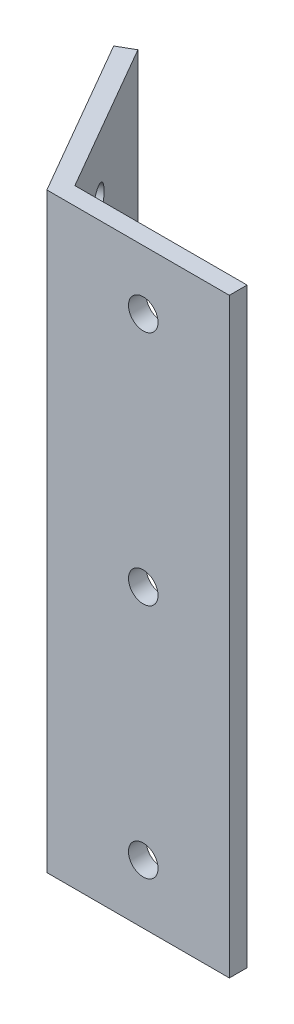
ISO-10303-21;
HEADER;
FILE_DESCRIPTION(('STEP AP214'),'2;1');
FILE_NAME('part.step','',(''),(''),'','','');
FILE_SCHEMA(('AUTOMOTIVE_DESIGN { 1 0 10303 214 1 1 1 1 }'));
ENDSEC;
DATA;
#1=APPLICATION_CONTEXT('core data for automotive mechanical design processes');
#2=APPLICATION_PROTOCOL_DEFINITION('international standard','automotive_design',2000,#1);
#3=PRODUCT_CONTEXT('',#1,'mechanical');
#4=PRODUCT('Part','Part','',(#3));
#5=PRODUCT_RELATED_PRODUCT_CATEGORY('part','',(#4));
#6=PRODUCT_DEFINITION_FORMATION('','',#4);
#7=PRODUCT_DEFINITION_CONTEXT('part definition',#1,'design');
#8=PRODUCT_DEFINITION('design','',#6,#7);
#9=PRODUCT_DEFINITION_SHAPE('','',#8);
#10=(LENGTH_UNIT() NAMED_UNIT(*) SI_UNIT(.MILLI.,.METRE.));
#11=(NAMED_UNIT(*) PLANE_ANGLE_UNIT() SI_UNIT($,.RADIAN.));
#12=(NAMED_UNIT(*) SI_UNIT($,.STERADIAN.) SOLID_ANGLE_UNIT());
#13=UNCERTAINTY_MEASURE_WITH_UNIT(LENGTH_MEASURE(1.E-05),#10,'distance_accuracy_value','');
#14=(GEOMETRIC_REPRESENTATION_CONTEXT(3) GLOBAL_UNCERTAINTY_ASSIGNED_CONTEXT((#13)) GLOBAL_UNIT_ASSIGNED_CONTEXT((#10,
#11,#12)) REPRESENTATION_CONTEXT('',''));
#15=CARTESIAN_POINT('',(0.,0.,0.));
#16=DIRECTION('',(0.,0.,1.));
#17=DIRECTION('',(1.,0.,0.));
#18=AXIS2_PLACEMENT_3D('',#15,#16,#17);
#19=CARTESIAN_POINT('',(1.29903810567665,100.,-0.750000000000006));
#20=DIRECTION('',(-0.866025403784436,0.,0.500000000000004));
#21=DIRECTION('',(0.500000000000004,0.,0.866025403784436));
#22=AXIS2_PLACEMENT_3D('',#19,#20,#21);
#23=PLANE('',#22);
#24=CARTESIAN_POINT('',(-4.63397459621561,90.,-11.0262794416288));
#25=DIRECTION('',(0.866025403784436,0.,-0.500000000000004));
#26=DIRECTION('',(-0.500000000000004,0.,-0.866025403784436));
#27=AXIS2_PLACEMENT_3D('',#24,#25,#26);
#28=CIRCLE('',#27,2.5);
#29=CARTESIAN_POINT('',(-5.88397459621562,90.,-13.1913429510899));
#30=VERTEX_POINT('',#29);
#31=EDGE_CURVE('E140',#30,#30,#28,.T.);
#32=ORIENTED_EDGE('',*,*,#31,.F.);
#33=EDGE_LOOP('',(#32));
#34=FACE_BOUND('',#33,.T.);
#35=CARTESIAN_POINT('',(-4.63397459621561,50.,-11.0262794416288));
#36=DIRECTION('',(0.866025403784436,0.,-0.500000000000004));
#37=DIRECTION('',(-0.500000000000004,0.,-0.866025403784436));
#38=AXIS2_PLACEMENT_3D('',#35,#36,#37);
#39=CIRCLE('',#38,2.50000000000001);
#40=CARTESIAN_POINT('',(-5.88397459621562,50.,-13.1913429510899));
#41=VERTEX_POINT('',#40);
#42=EDGE_CURVE('E190',#41,#41,#39,.T.);
#43=ORIENTED_EDGE('',*,*,#42,.F.);
#44=EDGE_LOOP('',(#43));
#45=FACE_BOUND('',#44,.T.);
#46=CARTESIAN_POINT('',(-4.63397459621561,10.,-11.0262794416288));
#47=DIRECTION('',(0.866025403784436,0.,-0.500000000000004));
#48=DIRECTION('',(-0.500000000000004,0.,-0.866025403784436));
#49=AXIS2_PLACEMENT_3D('',#46,#47,#48);
#50=CIRCLE('',#49,2.5);
#51=CARTESIAN_POINT('',(-5.88397459621562,10.,-13.1913429510899));
#52=VERTEX_POINT('',#51);
#53=EDGE_CURVE('E193',#52,#52,#50,.T.);
#54=ORIENTED_EDGE('',*,*,#53,.F.);
#55=EDGE_LOOP('',(#54));
#56=FACE_BOUND('',#55,.T.);
#57=DIRECTION('',(-0.500000000000004,0.,-0.866025403784436));
#58=VECTOR('',#57,1.);
#59=CARTESIAN_POINT('',(1.29903810567665,0.,-0.750000000000006));
#60=LINE('',#59,#58);
#61=CARTESIAN_POINT('',(0.866025403784434,0.,-1.5));
#62=VERTEX_POINT('',#61);
#63=CARTESIAN_POINT('',(-13.7009618943235,0.,-26.7307621135331));
#64=VERTEX_POINT('',#63);
#65=EDGE_CURVE('E120',#62,#64,#60,.T.);
#66=ORIENTED_EDGE('',*,*,#65,.T.);
#67=DIRECTION('',(0.,-1.,0.));
#68=VECTOR('',#67,1.);
#69=CARTESIAN_POINT('',(-13.7009618943235,100.,-26.7307621135331));
#70=LINE('',#69,#68);
#71=CARTESIAN_POINT('',(-13.7009618943235,100.,-26.7307621135331));
#72=VERTEX_POINT('',#71);
#73=EDGE_CURVE('E11',#72,#64,#70,.T.);
#74=ORIENTED_EDGE('',*,*,#73,.F.);
#75=DIRECTION('',(-0.500000000000004,0.,-0.866025403784436));
#76=VECTOR('',#75,1.);
#77=CARTESIAN_POINT('',(1.29903810567665,100.,-0.750000000000006));
#78=LINE('',#77,#76);
#79=CARTESIAN_POINT('',(0.866025403784434,100.,-1.5));
#80=VERTEX_POINT('',#79);
#81=EDGE_CURVE('E85',#80,#72,#78,.T.);
#82=ORIENTED_EDGE('',*,*,#81,.F.);
#83=DIRECTION('',(0.,-1.,0.));
#84=VECTOR('',#83,1.);
#85=CARTESIAN_POINT('',(0.866025403784434,100.,-1.5));
#86=LINE('',#85,#84);
#87=EDGE_CURVE('E116',#80,#62,#86,.T.);
#88=ORIENTED_EDGE('',*,*,#87,.T.);
#89=EDGE_LOOP('',(#66,#74,#82,#88));
#90=FACE_BOUND('',#89,.T.);
#91=ADVANCED_FACE('F37',(#34,#45,#56,#90),#23,.F.);
#92=CARTESIAN_POINT('',(-16.2990381056768,100.,-25.2307621135331));
#93=DIRECTION('',(-0.500000000000005,0.,-0.866025403784436));
#94=DIRECTION('',(-0.866025403784436,0.,0.500000000000005));
#95=AXIS2_PLACEMENT_3D('',#92,#93,#94);
#96=PLANE('',#95);
#97=DIRECTION('',(0.866025403784436,0.,-0.500000000000005));
#98=VECTOR('',#97,1.);
#99=CARTESIAN_POINT('',(-16.2990381056768,0.,-25.2307621135331));
#100=LINE('',#99,#98);
#101=CARTESIAN_POINT('',(-16.2990381056768,0.,-25.2307621135331));
#102=VERTEX_POINT('',#101);
#103=EDGE_CURVE('E123',#102,#64,#100,.T.);
#104=ORIENTED_EDGE('',*,*,#103,.F.);
#105=DIRECTION('',(0.,-1.,0.));
#106=VECTOR('',#105,1.);
#107=CARTESIAN_POINT('',(-16.2990381056768,100.,-25.2307621135331));
#108=LINE('',#107,#106);
#109=CARTESIAN_POINT('',(-16.2990381056768,100.,-25.2307621135331));
#110=VERTEX_POINT('',#109);
#111=EDGE_CURVE('E46',#110,#102,#108,.T.);
#112=ORIENTED_EDGE('',*,*,#111,.F.);
#113=DIRECTION('',(0.866025403784436,0.,-0.500000000000005));
#114=VECTOR('',#113,1.);
#115=CARTESIAN_POINT('',(-16.2990381056768,100.,-25.2307621135331));
#116=LINE('',#115,#114);
#117=EDGE_CURVE('E204',#110,#72,#116,.T.);
#118=ORIENTED_EDGE('',*,*,#117,.T.);
#119=ORIENTED_EDGE('',*,*,#73,.T.);
#120=EDGE_LOOP('',(#104,#112,#118,#119));
#121=FACE_BOUND('',#120,.T.);
#122=ADVANCED_FACE('F153',(#121),#96,.T.);
#123=CARTESIAN_POINT('',(-1.29903810567665,100.,0.750000000000006));
#124=DIRECTION('',(-0.866025403784436,0.,0.500000000000004));
#125=DIRECTION('',(0.500000000000004,0.,0.866025403784436));
#126=AXIS2_PLACEMENT_3D('',#123,#124,#125);
#127=PLANE('',#126);
#128=CARTESIAN_POINT('',(-7.23205080756892,90.,-9.52627944162878));
#129=DIRECTION('',(-0.866025403784436,0.,0.500000000000004));
#130=DIRECTION('',(0.500000000000004,0.,0.866025403784436));
#131=AXIS2_PLACEMENT_3D('',#128,#129,#130);
#132=CIRCLE('',#131,2.5);
#133=CARTESIAN_POINT('',(-5.98205080756891,90.,-7.36121593216769));
#134=VERTEX_POINT('',#133);
#135=EDGE_CURVE('E40',#134,#134,#132,.T.);
#136=ORIENTED_EDGE('',*,*,#135,.F.);
#137=EDGE_LOOP('',(#136));
#138=FACE_BOUND('',#137,.T.);
#139=CARTESIAN_POINT('',(-7.23205080756892,50.,-9.52627944162878));
#140=DIRECTION('',(-0.866025403784436,0.,0.500000000000004));
#141=DIRECTION('',(0.500000000000004,0.,0.866025403784436));
#142=AXIS2_PLACEMENT_3D('',#139,#140,#141);
#143=CIRCLE('',#142,2.50000000000001);
#144=CARTESIAN_POINT('',(-5.98205080756891,50.,-7.36121593216769));
#145=VERTEX_POINT('',#144);
#146=EDGE_CURVE('E139',#145,#145,#143,.T.);
#147=ORIENTED_EDGE('',*,*,#146,.F.);
#148=EDGE_LOOP('',(#147));
#149=FACE_BOUND('',#148,.T.);
#150=CARTESIAN_POINT('',(-7.23205080756892,10.,-9.52627944162879));
#151=DIRECTION('',(-0.866025403784436,0.,0.500000000000004));
#152=DIRECTION('',(0.500000000000004,0.,0.866025403784436));
#153=AXIS2_PLACEMENT_3D('',#150,#151,#152);
#154=CIRCLE('',#153,2.5);
#155=CARTESIAN_POINT('',(-5.98205080756891,10.,-7.36121593216769));
#156=VERTEX_POINT('',#155);
#157=EDGE_CURVE('E137',#156,#156,#154,.T.);
#158=ORIENTED_EDGE('',*,*,#157,.F.);
#159=EDGE_LOOP('',(#158));
#160=FACE_BOUND('',#159,.T.);
#161=DIRECTION('',(-0.500000000000004,0.,-0.866025403784436));
#162=VECTOR('',#161,1.);
#163=CARTESIAN_POINT('',(-1.29903810567665,0.,0.750000000000006));
#164=LINE('',#163,#162);
#165=CARTESIAN_POINT('',(-0.866025403784434,0.,1.5));
#166=VERTEX_POINT('',#165);
#167=EDGE_CURVE('E126',#166,#102,#164,.T.);
#168=ORIENTED_EDGE('',*,*,#167,.F.);
#169=DIRECTION('',(0.,-1.,0.));
#170=VECTOR('',#169,1.);
#171=CARTESIAN_POINT('',(-0.866025403784434,100.,1.5));
#172=LINE('',#171,#170);
#173=CARTESIAN_POINT('',(-0.866025403784434,100.,1.5));
#174=VERTEX_POINT('',#173);
#175=EDGE_CURVE('E106',#174,#166,#172,.T.);
#176=ORIENTED_EDGE('',*,*,#175,.F.);
#177=DIRECTION('',(-0.500000000000004,0.,-0.866025403784436));
#178=VECTOR('',#177,1.);
#179=CARTESIAN_POINT('',(-1.29903810567665,100.,0.750000000000006));
#180=LINE('',#179,#178);
#181=EDGE_CURVE('E112',#174,#110,#180,.T.);
#182=ORIENTED_EDGE('',*,*,#181,.T.);
#183=ORIENTED_EDGE('',*,*,#111,.T.);
#184=EDGE_LOOP('',(#168,#176,#182,#183));
#185=FACE_BOUND('',#184,.T.);
#186=ADVANCED_FACE('F150',(#138,#149,#160,#185),#127,.T.);
#187=CARTESIAN_POINT('',(0.,100.,1.5));
#188=DIRECTION('',(0.,0.,1.));
#189=DIRECTION('',(1.,0.,0.));
#190=AXIS2_PLACEMENT_3D('',#187,#188,#189);
#191=PLANE('',#190);
#192=CARTESIAN_POINT('',(15.4330127018922,90.,1.5));
#193=DIRECTION('',(0.,0.,1.));
#194=DIRECTION('',(1.,0.,0.));
#195=AXIS2_PLACEMENT_3D('',#192,#193,#194);
#196=CIRCLE('',#195,2.5);
#197=CARTESIAN_POINT('',(17.9330127018922,90.,1.5));
#198=VERTEX_POINT('',#197);
#199=EDGE_CURVE('E195',#198,#198,#196,.T.);
#200=ORIENTED_EDGE('',*,*,#199,.F.);
#201=EDGE_LOOP('',(#200));
#202=FACE_BOUND('',#201,.T.);
#203=CARTESIAN_POINT('',(15.4330127018922,10.,1.5));
#204=DIRECTION('',(0.,0.,1.));
#205=DIRECTION('',(1.,0.,0.));
#206=AXIS2_PLACEMENT_3D('',#203,#204,#205);
#207=CIRCLE('',#206,2.5);
#208=CARTESIAN_POINT('',(17.9330127018922,10.,1.5));
#209=VERTEX_POINT('',#208);
#210=EDGE_CURVE('E199',#209,#209,#207,.T.);
#211=ORIENTED_EDGE('',*,*,#210,.F.);
#212=EDGE_LOOP('',(#211));
#213=FACE_BOUND('',#212,.T.);
#214=CARTESIAN_POINT('',(15.4330127018922,50.,1.5));
#215=DIRECTION('',(0.,0.,1.));
#216=DIRECTION('',(1.,0.,0.));
#217=AXIS2_PLACEMENT_3D('',#214,#215,#216);
#218=CIRCLE('',#217,2.5);
#219=CARTESIAN_POINT('',(17.9330127018922,50.,1.5));
#220=VERTEX_POINT('',#219);
#221=EDGE_CURVE('E208',#220,#220,#218,.T.);
#222=ORIENTED_EDGE('',*,*,#221,.F.);
#223=EDGE_LOOP('',(#222));
#224=FACE_BOUND('',#223,.T.);
#225=DIRECTION('',(1.,0.,0.));
#226=VECTOR('',#225,1.);
#227=CARTESIAN_POINT('',(0.,0.,1.5));
#228=LINE('',#227,#226);
#229=CARTESIAN_POINT('',(30.,0.,1.5));
#230=VERTEX_POINT('',#229);
#231=EDGE_CURVE('E101',#230,#166,#228,.F.);
#232=ORIENTED_EDGE('',*,*,#231,.F.);
#233=DIRECTION('',(0.,-1.,0.));
#234=VECTOR('',#233,1.);
#235=CARTESIAN_POINT('',(30.,100.,1.5));
#236=LINE('',#235,#234);
#237=CARTESIAN_POINT('',(30.,100.,1.5));
#238=VERTEX_POINT('',#237);
#239=EDGE_CURVE('E96',#238,#230,#236,.T.);
#240=ORIENTED_EDGE('',*,*,#239,.F.);
#241=DIRECTION('',(1.,0.,0.));
#242=VECTOR('',#241,1.);
#243=CARTESIAN_POINT('',(0.,100.,1.5));
#244=LINE('',#243,#242);
#245=EDGE_CURVE('E99',#238,#174,#244,.F.);
#246=ORIENTED_EDGE('',*,*,#245,.T.);
#247=ORIENTED_EDGE('',*,*,#175,.T.);
#248=EDGE_LOOP('',(#232,#240,#246,#247));
#249=FACE_BOUND('',#248,.T.);
#250=ADVANCED_FACE('F98',(#202,#213,#224,#249),#191,.T.);
#251=CARTESIAN_POINT('',(30.,100.,-1.5));
#252=DIRECTION('',(1.,0.,0.));
#253=DIRECTION('',(0.,0.,-1.));
#254=AXIS2_PLACEMENT_3D('',#251,#252,#253);
#255=PLANE('',#254);
#256=DIRECTION('',(0.,0.,1.));
#257=VECTOR('',#256,1.);
#258=CARTESIAN_POINT('',(30.,0.,-1.5));
#259=LINE('',#258,#257);
#260=CARTESIAN_POINT('',(30.,0.,-1.5));
#261=VERTEX_POINT('',#260);
#262=EDGE_CURVE('E130',#261,#230,#259,.T.);
#263=ORIENTED_EDGE('',*,*,#262,.F.);
#264=DIRECTION('',(0.,-1.,0.));
#265=VECTOR('',#264,1.);
#266=CARTESIAN_POINT('',(30.,100.,-1.5));
#267=LINE('',#266,#265);
#268=CARTESIAN_POINT('',(30.,100.,-1.5));
#269=VERTEX_POINT('',#268);
#270=EDGE_CURVE('E76',#269,#261,#267,.T.);
#271=ORIENTED_EDGE('',*,*,#270,.F.);
#272=DIRECTION('',(0.,0.,1.));
#273=VECTOR('',#272,1.);
#274=CARTESIAN_POINT('',(30.,100.,-1.5));
#275=LINE('',#274,#273);
#276=EDGE_CURVE('E110',#269,#238,#275,.T.);
#277=ORIENTED_EDGE('',*,*,#276,.T.);
#278=ORIENTED_EDGE('',*,*,#239,.T.);
#279=EDGE_LOOP('',(#263,#271,#277,#278));
#280=FACE_BOUND('',#279,.T.);
#281=ADVANCED_FACE('F114',(#280),#255,.T.);
#282=CARTESIAN_POINT('',(0.,100.,-1.5));
#283=DIRECTION('',(0.,0.,1.));
#284=DIRECTION('',(1.,0.,0.));
#285=AXIS2_PLACEMENT_3D('',#282,#283,#284);
#286=PLANE('',#285);
#287=CARTESIAN_POINT('',(15.4330127018922,90.,-1.5));
#288=DIRECTION('',(0.,0.,-1.));
#289=DIRECTION('',(-1.,0.,0.));
#290=AXIS2_PLACEMENT_3D('',#287,#288,#289);
#291=CIRCLE('',#290,2.5);
#292=CARTESIAN_POINT('',(12.9330127018922,90.,-1.5));
#293=VERTEX_POINT('',#292);
#294=EDGE_CURVE('E215',#293,#293,#291,.T.);
#295=ORIENTED_EDGE('',*,*,#294,.F.);
#296=EDGE_LOOP('',(#295));
#297=FACE_BOUND('',#296,.T.);
#298=CARTESIAN_POINT('',(15.4330127018922,10.,-1.5));
#299=DIRECTION('',(0.,0.,-1.));
#300=DIRECTION('',(-1.,0.,0.));
#301=AXIS2_PLACEMENT_3D('',#298,#299,#300);
#302=CIRCLE('',#301,2.5);
#303=CARTESIAN_POINT('',(12.9330127018922,10.,-1.5));
#304=VERTEX_POINT('',#303);
#305=EDGE_CURVE('E214',#304,#304,#302,.T.);
#306=ORIENTED_EDGE('',*,*,#305,.F.);
#307=EDGE_LOOP('',(#306));
#308=FACE_BOUND('',#307,.T.);
#309=CARTESIAN_POINT('',(15.4330127018922,50.,-1.5));
#310=DIRECTION('',(0.,0.,-1.));
#311=DIRECTION('',(-1.,0.,0.));
#312=AXIS2_PLACEMENT_3D('',#309,#310,#311);
#313=CIRCLE('',#312,2.5);
#314=CARTESIAN_POINT('',(12.9330127018922,50.,-1.5));
#315=VERTEX_POINT('',#314);
#316=EDGE_CURVE('E211',#315,#315,#313,.T.);
#317=ORIENTED_EDGE('',*,*,#316,.F.);
#318=EDGE_LOOP('',(#317));
#319=FACE_BOUND('',#318,.T.);
#320=DIRECTION('',(1.,0.,0.));
#321=VECTOR('',#320,1.);
#322=CARTESIAN_POINT('',(0.,0.,-1.5));
#323=LINE('',#322,#321);
#324=EDGE_CURVE('E79',#261,#62,#323,.F.);
#325=ORIENTED_EDGE('',*,*,#324,.T.);
#326=ORIENTED_EDGE('',*,*,#87,.F.);
#327=DIRECTION('',(1.,0.,0.));
#328=VECTOR('',#327,1.);
#329=CARTESIAN_POINT('',(0.,100.,-1.5));
#330=LINE('',#329,#328);
#331=EDGE_CURVE('E55',#269,#80,#330,.F.);
#332=ORIENTED_EDGE('',*,*,#331,.F.);
#333=ORIENTED_EDGE('',*,*,#270,.T.);
#334=EDGE_LOOP('',(#325,#326,#332,#333));
#335=FACE_BOUND('',#334,.T.);
#336=ADVANCED_FACE('F165',(#297,#308,#319,#335),#286,.F.);
#337=CARTESIAN_POINT('',(0.,100.,0.));
#338=DIRECTION('',(0.,-1.,0.));
#339=DIRECTION('',(-1.,0.,0.));
#340=AXIS2_PLACEMENT_3D('',#337,#338,#339);
#341=PLANE('',#340);
#342=ORIENTED_EDGE('',*,*,#81,.T.);
#343=ORIENTED_EDGE('',*,*,#117,.F.);
#344=ORIENTED_EDGE('',*,*,#181,.F.);
#345=ORIENTED_EDGE('',*,*,#245,.F.);
#346=ORIENTED_EDGE('',*,*,#276,.F.);
#347=ORIENTED_EDGE('',*,*,#331,.T.);
#348=EDGE_LOOP('',(#342,#343,#344,#345,#346,#347));
#349=FACE_BOUND('',#348,.T.);
#350=ADVANCED_FACE('F109',(#349),#341,.F.);
#351=CARTESIAN_POINT('',(0.,0.,0.));
#352=DIRECTION('',(0.,-1.,0.));
#353=DIRECTION('',(-1.,0.,0.));
#354=AXIS2_PLACEMENT_3D('',#351,#352,#353);
#355=PLANE('',#354);
#356=ORIENTED_EDGE('',*,*,#65,.F.);
#357=ORIENTED_EDGE('',*,*,#324,.F.);
#358=ORIENTED_EDGE('',*,*,#262,.T.);
#359=ORIENTED_EDGE('',*,*,#231,.T.);
#360=ORIENTED_EDGE('',*,*,#167,.T.);
#361=ORIENTED_EDGE('',*,*,#103,.T.);
#362=EDGE_LOOP('',(#356,#357,#358,#359,#360,#361));
#363=FACE_BOUND('',#362,.T.);
#364=ADVANCED_FACE('F162',(#363),#355,.T.);
#365=CARTESIAN_POINT('',(-13.29422863406,10.,-6.02627944162876));
#366=DIRECTION('',(0.866025403784436,0.,-0.500000000000004));
#367=DIRECTION('',(-0.500000000000004,0.,-0.866025403784436));
#368=AXIS2_PLACEMENT_3D('',#365,#366,#367);
#369=CYLINDRICAL_SURFACE('',#368,2.5);
#370=ORIENTED_EDGE('',*,*,#157,.T.);
#371=EDGE_LOOP('',(#370));
#372=FACE_BOUND('',#371,.T.);
#373=ORIENTED_EDGE('',*,*,#53,.T.);
#374=EDGE_LOOP('',(#373));
#375=FACE_BOUND('',#374,.T.);
#376=ADVANCED_FACE('F242',(#372,#375),#369,.F.);
#377=CARTESIAN_POINT('',(-13.29422863406,50.,-6.02627944162876));
#378=DIRECTION('',(0.866025403784436,0.,-0.500000000000004));
#379=DIRECTION('',(-0.500000000000004,0.,-0.866025403784436));
#380=AXIS2_PLACEMENT_3D('',#377,#378,#379);
#381=CYLINDRICAL_SURFACE('',#380,2.50000000000001);
#382=ORIENTED_EDGE('',*,*,#146,.T.);
#383=EDGE_LOOP('',(#382));
#384=FACE_BOUND('',#383,.T.);
#385=ORIENTED_EDGE('',*,*,#42,.T.);
#386=EDGE_LOOP('',(#385));
#387=FACE_BOUND('',#386,.T.);
#388=ADVANCED_FACE('F236',(#384,#387),#381,.F.);
#389=CARTESIAN_POINT('',(-13.29422863406,90.,-6.02627944162875));
#390=DIRECTION('',(0.866025403784436,0.,-0.500000000000004));
#391=DIRECTION('',(-0.500000000000004,0.,-0.866025403784436));
#392=AXIS2_PLACEMENT_3D('',#389,#390,#391);
#393=CYLINDRICAL_SURFACE('',#392,2.5);
#394=ORIENTED_EDGE('',*,*,#135,.T.);
#395=EDGE_LOOP('',(#394));
#396=FACE_BOUND('',#395,.T.);
#397=ORIENTED_EDGE('',*,*,#31,.T.);
#398=EDGE_LOOP('',(#397));
#399=FACE_BOUND('',#398,.T.);
#400=ADVANCED_FACE('F147',(#396,#399),#393,.F.);
#401=CARTESIAN_POINT('',(15.4330127018922,50.,8.5));
#402=DIRECTION('',(0.,0.,-1.));
#403=DIRECTION('',(-1.,0.,0.));
#404=AXIS2_PLACEMENT_3D('',#401,#402,#403);
#405=CYLINDRICAL_SURFACE('',#404,2.5);
#406=ORIENTED_EDGE('',*,*,#221,.T.);
#407=EDGE_LOOP('',(#406));
#408=FACE_BOUND('',#407,.T.);
#409=ORIENTED_EDGE('',*,*,#316,.T.);
#410=EDGE_LOOP('',(#409));
#411=FACE_BOUND('',#410,.T.);
#412=ADVANCED_FACE('F225',(#408,#411),#405,.F.);
#413=CARTESIAN_POINT('',(15.4330127018922,10.,8.5));
#414=DIRECTION('',(0.,0.,-1.));
#415=DIRECTION('',(-1.,0.,0.));
#416=AXIS2_PLACEMENT_3D('',#413,#414,#415);
#417=CYLINDRICAL_SURFACE('',#416,2.5);
#418=ORIENTED_EDGE('',*,*,#210,.T.);
#419=EDGE_LOOP('',(#418));
#420=FACE_BOUND('',#419,.T.);
#421=ORIENTED_EDGE('',*,*,#305,.T.);
#422=EDGE_LOOP('',(#421));
#423=FACE_BOUND('',#422,.T.);
#424=ADVANCED_FACE('F221',(#420,#423),#417,.F.);
#425=CARTESIAN_POINT('',(15.4330127018922,90.,8.5));
#426=DIRECTION('',(0.,0.,-1.));
#427=DIRECTION('',(-1.,0.,0.));
#428=AXIS2_PLACEMENT_3D('',#425,#426,#427);
#429=CYLINDRICAL_SURFACE('',#428,2.5);
#430=ORIENTED_EDGE('',*,*,#199,.T.);
#431=EDGE_LOOP('',(#430));
#432=FACE_BOUND('',#431,.T.);
#433=ORIENTED_EDGE('',*,*,#294,.T.);
#434=EDGE_LOOP('',(#433));
#435=FACE_BOUND('',#434,.T.);
#436=ADVANCED_FACE('F233',(#432,#435),#429,.F.);
#437=CLOSED_SHELL('',(#91,#122,#186,#250,#281,#336,#350,#364,#376,#388,#400,#412,#424,#436));
#438=MANIFOLD_SOLID_BREP('B2',#437);
#439=ADVANCED_BREP_SHAPE_REPRESENTATION('',(#18,#438),#14);
#440=SHAPE_DEFINITION_REPRESENTATION(#9,#439);
ENDSEC;
END-ISO-10303-21;
